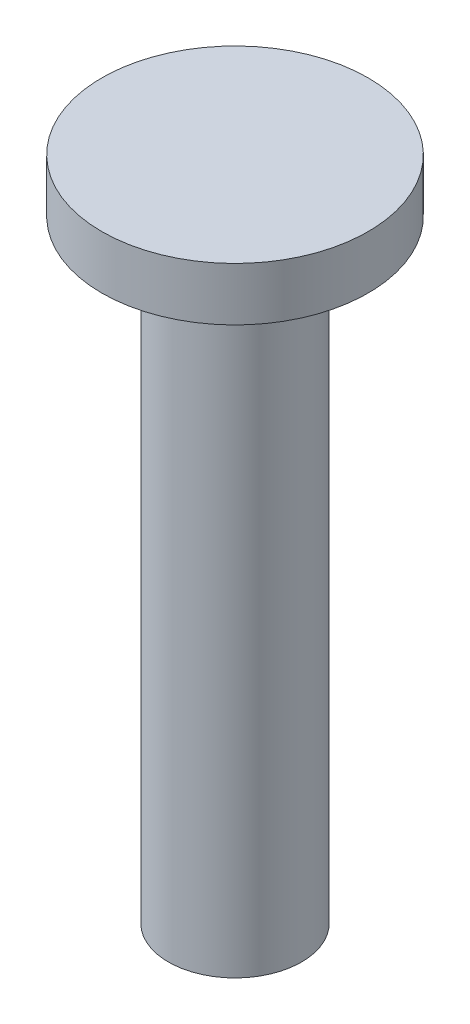
ISO-10303-21;
HEADER;
FILE_DESCRIPTION(('STEP AP214'),'2;1');
FILE_NAME('part.step','',(''),(''),'','','');
FILE_SCHEMA(('AUTOMOTIVE_DESIGN { 1 0 10303 214 1 1 1 1 }'));
ENDSEC;
DATA;
#1=APPLICATION_CONTEXT('core data for automotive mechanical design processes');
#2=APPLICATION_PROTOCOL_DEFINITION('international standard','automotive_design',2000,#1);
#3=PRODUCT_CONTEXT('',#1,'mechanical');
#4=PRODUCT('Part','Part','',(#3));
#5=PRODUCT_RELATED_PRODUCT_CATEGORY('part','',(#4));
#6=PRODUCT_DEFINITION_FORMATION('','',#4);
#7=PRODUCT_DEFINITION_CONTEXT('part definition',#1,'design');
#8=PRODUCT_DEFINITION('design','',#6,#7);
#9=PRODUCT_DEFINITION_SHAPE('','',#8);
#10=(LENGTH_UNIT() NAMED_UNIT(*) SI_UNIT(.MILLI.,.METRE.));
#11=(NAMED_UNIT(*) PLANE_ANGLE_UNIT() SI_UNIT($,.RADIAN.));
#12=(NAMED_UNIT(*) SI_UNIT($,.STERADIAN.) SOLID_ANGLE_UNIT());
#13=UNCERTAINTY_MEASURE_WITH_UNIT(LENGTH_MEASURE(1.E-05),#10,'distance_accuracy_value','');
#14=(GEOMETRIC_REPRESENTATION_CONTEXT(3) GLOBAL_UNCERTAINTY_ASSIGNED_CONTEXT((#13)) GLOBAL_UNIT_ASSIGNED_CONTEXT((#10,
#11,#12)) REPRESENTATION_CONTEXT('',''));
#15=CARTESIAN_POINT('',(0.,0.,0.));
#16=DIRECTION('',(0.,0.,1.));
#17=DIRECTION('',(1.,0.,0.));
#18=AXIS2_PLACEMENT_3D('',#15,#16,#17);
#19=CARTESIAN_POINT('',(0.,0.,0.));
#20=DIRECTION('',(0.,1.,0.));
#21=DIRECTION('',(0.,0.,1.));
#22=AXIS2_PLACEMENT_3D('',#19,#20,#21);
#23=PLANE('',#22);
#24=CARTESIAN_POINT('',(0.,0.,0.));
#25=DIRECTION('',(0.,-1.,0.));
#26=DIRECTION('',(0.,0.,-1.));
#27=AXIS2_PLACEMENT_3D('',#24,#25,#26);
#28=CIRCLE('',#27,1.);
#29=CARTESIAN_POINT('',(0.,0.,-1.));
#30=VERTEX_POINT('',#29);
#31=EDGE_CURVE('E10',#30,#30,#28,.T.);
#32=ORIENTED_EDGE('',*,*,#31,.T.);
#33=EDGE_LOOP('',(#32));
#34=FACE_BOUND('',#33,.T.);
#35=ADVANCED_FACE('F37',(#34),#23,.F.);
#36=CARTESIAN_POINT('',(0.,0.,0.));
#37=DIRECTION('',(0.,-1.,0.));
#38=DIRECTION('',(0.,0.,-1.));
#39=AXIS2_PLACEMENT_3D('',#36,#37,#38);
#40=CYLINDRICAL_SURFACE('',#39,1.);
#41=ORIENTED_EDGE('',*,*,#31,.F.);
#42=EDGE_LOOP('',(#41));
#43=FACE_BOUND('',#42,.T.);
#44=CARTESIAN_POINT('',(0.,9.2,0.));
#45=DIRECTION('',(0.,-1.,0.));
#46=DIRECTION('',(0.,0.,-1.));
#47=AXIS2_PLACEMENT_3D('',#44,#45,#46);
#48=CIRCLE('',#47,1.);
#49=CARTESIAN_POINT('',(0.,9.2,-1.));
#50=VERTEX_POINT('',#49);
#51=EDGE_CURVE('E44',#50,#50,#48,.T.);
#52=ORIENTED_EDGE('',*,*,#51,.T.);
#53=EDGE_LOOP('',(#52));
#54=FACE_BOUND('',#53,.T.);
#55=ADVANCED_FACE('F73',(#43,#54),#40,.T.);
#56=CARTESIAN_POINT('',(-1.,9.2,0.));
#57=DIRECTION('',(0.,1.,0.));
#58=DIRECTION('',(0.,0.,1.));
#59=AXIS2_PLACEMENT_3D('',#56,#57,#58);
#60=PLANE('',#59);
#61=ORIENTED_EDGE('',*,*,#51,.F.);
#62=EDGE_LOOP('',(#61));
#63=FACE_BOUND('',#62,.T.);
#64=CARTESIAN_POINT('',(0.,9.2,0.));
#65=DIRECTION('',(0.,-1.,0.));
#66=DIRECTION('',(0.,0.,-1.));
#67=AXIS2_PLACEMENT_3D('',#64,#65,#66);
#68=CIRCLE('',#67,2.);
#69=CARTESIAN_POINT('',(0.,9.2,-2.));
#70=VERTEX_POINT('',#69);
#71=EDGE_CURVE('E49',#70,#70,#68,.T.);
#72=ORIENTED_EDGE('',*,*,#71,.T.);
#73=EDGE_LOOP('',(#72));
#74=FACE_BOUND('',#73,.T.);
#75=ADVANCED_FACE('F69',(#63,#74),#60,.F.);
#76=CARTESIAN_POINT('',(0.,0.,0.));
#77=DIRECTION('',(0.,-1.,0.));
#78=DIRECTION('',(0.,0.,-1.));
#79=AXIS2_PLACEMENT_3D('',#76,#77,#78);
#80=CYLINDRICAL_SURFACE('',#79,2.);
#81=ORIENTED_EDGE('',*,*,#71,.F.);
#82=EDGE_LOOP('',(#81));
#83=FACE_BOUND('',#82,.T.);
#84=CARTESIAN_POINT('',(0.,10.,0.));
#85=DIRECTION('',(0.,-1.,0.));
#86=DIRECTION('',(0.,0.,-1.));
#87=AXIS2_PLACEMENT_3D('',#84,#85,#86);
#88=CIRCLE('',#87,2.);
#89=CARTESIAN_POINT('',(0.,10.,-2.));
#90=VERTEX_POINT('',#89);
#91=EDGE_CURVE('E54',#90,#90,#88,.T.);
#92=ORIENTED_EDGE('',*,*,#91,.T.);
#93=EDGE_LOOP('',(#92));
#94=FACE_BOUND('',#93,.T.);
#95=ADVANCED_FACE('F61',(#83,#94),#80,.T.);
#96=CARTESIAN_POINT('',(-2.,10.,0.));
#97=DIRECTION('',(0.,-1.,0.));
#98=DIRECTION('',(0.,0.,-1.));
#99=AXIS2_PLACEMENT_3D('',#96,#97,#98);
#100=PLANE('',#99);
#101=ORIENTED_EDGE('',*,*,#91,.F.);
#102=EDGE_LOOP('',(#101));
#103=FACE_BOUND('',#102,.T.);
#104=ADVANCED_FACE('F63',(#103),#100,.F.);
#105=CLOSED_SHELL('',(#35,#55,#75,#95,#104));
#106=MANIFOLD_SOLID_BREP('B2',#105);
#107=ADVANCED_BREP_SHAPE_REPRESENTATION('',(#18,#106),#14);
#108=SHAPE_DEFINITION_REPRESENTATION(#9,#107);
ENDSEC;
END-ISO-10303-21;
